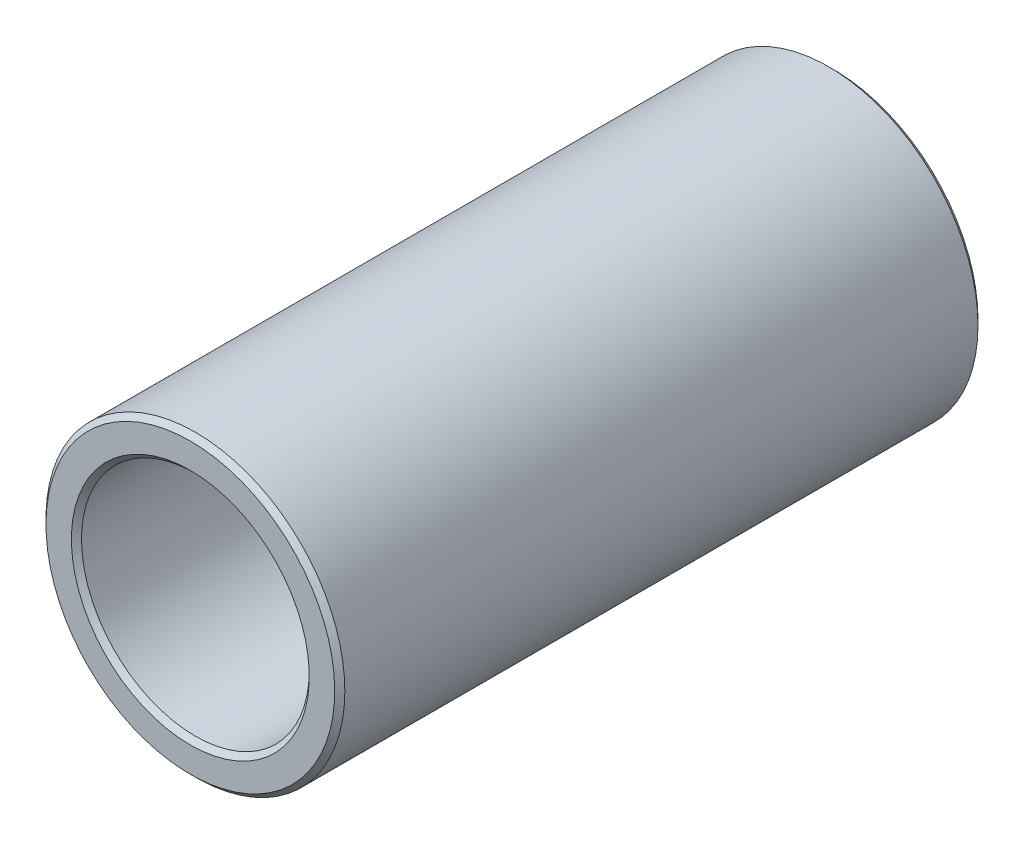
ISO-10303-21;
HEADER;
FILE_DESCRIPTION(('STEP AP214'),'2;1');
FILE_NAME('part.step','',(''),(''),'','','');
FILE_SCHEMA(('AUTOMOTIVE_DESIGN { 1 0 10303 214 1 1 1 1 }'));
ENDSEC;
DATA;
#1=APPLICATION_CONTEXT('core data for automotive mechanical design processes');
#2=APPLICATION_PROTOCOL_DEFINITION('international standard','automotive_design',2000,#1);
#3=PRODUCT_CONTEXT('',#1,'mechanical');
#4=PRODUCT('Part','Part','',(#3));
#5=PRODUCT_RELATED_PRODUCT_CATEGORY('part','',(#4));
#6=PRODUCT_DEFINITION_FORMATION('','',#4);
#7=PRODUCT_DEFINITION_CONTEXT('part definition',#1,'design');
#8=PRODUCT_DEFINITION('design','',#6,#7);
#9=PRODUCT_DEFINITION_SHAPE('','',#8);
#10=(LENGTH_UNIT() NAMED_UNIT(*) SI_UNIT(.MILLI.,.METRE.));
#11=(NAMED_UNIT(*) PLANE_ANGLE_UNIT() SI_UNIT($,.RADIAN.));
#12=(NAMED_UNIT(*) SI_UNIT($,.STERADIAN.) SOLID_ANGLE_UNIT());
#13=UNCERTAINTY_MEASURE_WITH_UNIT(LENGTH_MEASURE(1.E-05),#10,'distance_accuracy_value','');
#14=(GEOMETRIC_REPRESENTATION_CONTEXT(3) GLOBAL_UNCERTAINTY_ASSIGNED_CONTEXT((#13)) GLOBAL_UNIT_ASSIGNED_CONTEXT((#10,
#11,#12)) REPRESENTATION_CONTEXT('',''));
#15=CARTESIAN_POINT('',(0.,0.,0.));
#16=DIRECTION('',(0.,0.,1.));
#17=DIRECTION('',(1.,0.,0.));
#18=AXIS2_PLACEMENT_3D('',#15,#16,#17);
#19=CARTESIAN_POINT('',(0.,0.,7.37616));
#20=DIRECTION('',(0.,0.,1.));
#21=DIRECTION('',(1.,0.,0.));
#22=AXIS2_PLACEMENT_3D('',#19,#20,#21);
#23=CYLINDRICAL_SURFACE('',#22,2.2479);
#24=CARTESIAN_POINT('',(0.,0.,6.25000000002274));
#25=DIRECTION('',(0.,0.,1.));
#26=DIRECTION('',(1.,0.,0.));
#27=AXIS2_PLACEMENT_3D('',#24,#25,#26);
#28=CIRCLE('',#27,2.24790000004305);
#29=CARTESIAN_POINT('',(2.24790000004305,0.,6.25000000002274));
#30=VERTEX_POINT('',#29);
#31=EDGE_CURVE('E29',#30,#30,#28,.T.);
#32=ORIENTED_EDGE('',*,*,#31,.T.);
#33=EDGE_LOOP('',(#32));
#34=FACE_BOUND('',#33,.T.);
#35=CARTESIAN_POINT('',(0.,0.,-6.24999999996589));
#36=DIRECTION('',(0.,0.,-1.));
#37=DIRECTION('',(-1.,0.,0.));
#38=AXIS2_PLACEMENT_3D('',#35,#36,#37);
#39=CIRCLE('',#38,2.2478999999862);
#40=CARTESIAN_POINT('',(-2.2478999999862,0.,-6.24999999996589));
#41=VERTEX_POINT('',#40);
#42=EDGE_CURVE('E32',#41,#41,#39,.T.);
#43=ORIENTED_EDGE('',*,*,#42,.T.);
#44=EDGE_LOOP('',(#43));
#45=FACE_BOUND('',#44,.T.);
#46=ADVANCED_FACE('F14',(#34,#45),#23,.F.);
#47=CARTESIAN_POINT('',(0.,0.,-6.34999999994079));
#48=DIRECTION('',(0.,0.,-1.));
#49=DIRECTION('',(-1.,0.,0.));
#50=AXIS2_PLACEMENT_3D('',#47,#48,#49);
#51=CONICAL_SURFACE('',#50,2.34789999990426,0.785398163397448);
#52=CARTESIAN_POINT('',(0.,0.,-6.34999999999764));
#53=DIRECTION('',(0.,0.,-1.));
#54=DIRECTION('',(-1.,0.,0.));
#55=AXIS2_PLACEMENT_3D('',#52,#53,#54);
#56=CIRCLE('',#55,2.3478999999611);
#57=CARTESIAN_POINT('',(-2.3478999999611,0.,-6.34999999999764));
#58=VERTEX_POINT('',#57);
#59=EDGE_CURVE('E17',#58,#58,#56,.T.);
#60=ORIENTED_EDGE('',*,*,#59,.T.);
#61=EDGE_LOOP('',(#60));
#62=FACE_BOUND('',#61,.T.);
#63=ORIENTED_EDGE('',*,*,#42,.F.);
#64=EDGE_LOOP('',(#63));
#65=FACE_BOUND('',#64,.T.);
#66=ADVANCED_FACE('F46',(#62,#65),#51,.F.);
#67=CARTESIAN_POINT('',(0.,0.,6.34999999988395));
#68=DIRECTION('',(0.,0.,1.));
#69=DIRECTION('',(0.,-1.,0.));
#70=AXIS2_PLACEMENT_3D('',#67,#68,#69);
#71=CONICAL_SURFACE('',#70,2.34789999990426,0.785398163397448);
#72=CARTESIAN_POINT('',(0.,0.,6.34999999994079));
#73=DIRECTION('',(0.,0.,1.));
#74=DIRECTION('',(0.,-1.,0.));
#75=AXIS2_PLACEMENT_3D('',#72,#73,#74);
#76=CIRCLE('',#75,2.3478999999611);
#77=CARTESIAN_POINT('',(0.,-2.3478999999611,6.34999999994079));
#78=VERTEX_POINT('',#77);
#79=EDGE_CURVE('E39',#78,#78,#76,.T.);
#80=ORIENTED_EDGE('',*,*,#79,.T.);
#81=EDGE_LOOP('',(#80));
#82=FACE_BOUND('',#81,.T.);
#83=ORIENTED_EDGE('',*,*,#31,.F.);
#84=EDGE_LOOP('',(#83));
#85=FACE_BOUND('',#84,.T.);
#86=ADVANCED_FACE('F52',(#82,#85),#71,.F.);
#87=CARTESIAN_POINT('',(0.,2.95,-6.35));
#88=DIRECTION('',(0.,0.,1.));
#89=DIRECTION('',(1.,0.,0.));
#90=AXIS2_PLACEMENT_3D('',#87,#88,#89);
#91=PLANE('',#90);
#92=CARTESIAN_POINT('',(0.,0.,-6.35000000005448));
#93=DIRECTION('',(0.,0.,1.));
#94=DIRECTION('',(1.,0.,0.));
#95=AXIS2_PLACEMENT_3D('',#92,#93,#94);
#96=CIRCLE('',#95,2.84999999996671);
#97=CARTESIAN_POINT('',(2.84999999996671,0.,-6.35000000005448));
#98=VERTEX_POINT('',#97);
#99=EDGE_CURVE('E37',#98,#98,#96,.T.);
#100=ORIENTED_EDGE('',*,*,#99,.F.);
#101=EDGE_LOOP('',(#100));
#102=FACE_BOUND('',#101,.T.);
#103=ORIENTED_EDGE('',*,*,#59,.F.);
#104=EDGE_LOOP('',(#103));
#105=FACE_BOUND('',#104,.T.);
#106=ADVANCED_FACE('F49',(#102,#105),#91,.F.);
#107=CARTESIAN_POINT('',(0.,2.95,6.35));
#108=DIRECTION('',(0.,0.,-1.));
#109=DIRECTION('',(-1.,0.,0.));
#110=AXIS2_PLACEMENT_3D('',#107,#108,#109);
#111=PLANE('',#110);
#112=CARTESIAN_POINT('',(0.,0.,6.34999999999764));
#113=DIRECTION('',(0.,0.,-1.));
#114=DIRECTION('',(0.,1.,0.));
#115=AXIS2_PLACEMENT_3D('',#112,#113,#114);
#116=CIRCLE('',#115,2.8500000000804);
#117=CARTESIAN_POINT('',(0.,2.8500000000804,6.34999999999764));
#118=VERTEX_POINT('',#117);
#119=EDGE_CURVE('E26',#118,#118,#116,.T.);
#120=ORIENTED_EDGE('',*,*,#119,.F.);
#121=EDGE_LOOP('',(#120));
#122=FACE_BOUND('',#121,.T.);
#123=ORIENTED_EDGE('',*,*,#79,.F.);
#124=EDGE_LOOP('',(#123));
#125=FACE_BOUND('',#124,.T.);
#126=ADVANCED_FACE('F51',(#122,#125),#111,.F.);
#127=CARTESIAN_POINT('',(0.,0.,-6.25000000002274));
#128=DIRECTION('',(0.,0.,1.));
#129=DIRECTION('',(1.,0.,0.));
#130=AXIS2_PLACEMENT_3D('',#127,#128,#129);
#131=CONICAL_SURFACE('',#130,2.94999999999845,0.785398163397448);
#132=CARTESIAN_POINT('',(0.,0.,-6.25));
#133=DIRECTION('',(0.,0.,1.));
#134=DIRECTION('',(1.,0.,0.));
#135=AXIS2_PLACEMENT_3D('',#132,#133,#134);
#136=CIRCLE('',#135,2.95);
#137=CARTESIAN_POINT('',(2.95,0.,-6.25));
#138=VERTEX_POINT('',#137);
#139=EDGE_CURVE('E21',#138,#138,#136,.T.);
#140=ORIENTED_EDGE('',*,*,#139,.F.);
#141=EDGE_LOOP('',(#140));
#142=FACE_BOUND('',#141,.T.);
#143=ORIENTED_EDGE('',*,*,#99,.T.);
#144=EDGE_LOOP('',(#143));
#145=FACE_BOUND('',#144,.T.);
#146=ADVANCED_FACE('F60',(#142,#145),#131,.T.);
#147=CARTESIAN_POINT('',(0.,0.,6.25000000013642));
#148=DIRECTION('',(0.,0.,-1.));
#149=DIRECTION('',(0.,1.,0.));
#150=AXIS2_PLACEMENT_3D('',#147,#148,#149);
#151=CONICAL_SURFACE('',#150,2.94999999988477,0.785398163113231);
#152=CARTESIAN_POINT('',(0.,0.,6.25));
#153=DIRECTION('',(0.,0.,1.));
#154=DIRECTION('',(1.,0.,0.));
#155=AXIS2_PLACEMENT_3D('',#152,#153,#154);
#156=CIRCLE('',#155,2.95);
#157=CARTESIAN_POINT('',(2.95,0.,6.25));
#158=VERTEX_POINT('',#157);
#159=EDGE_CURVE('E10',#158,#158,#156,.F.);
#160=ORIENTED_EDGE('',*,*,#159,.F.);
#161=EDGE_LOOP('',(#160));
#162=FACE_BOUND('',#161,.T.);
#163=ORIENTED_EDGE('',*,*,#119,.T.);
#164=EDGE_LOOP('',(#163));
#165=FACE_BOUND('',#164,.T.);
#166=ADVANCED_FACE('F67',(#162,#165),#151,.T.);
#167=CARTESIAN_POINT('',(0.,0.,7.37616));
#168=DIRECTION('',(0.,0.,1.));
#169=DIRECTION('',(1.,0.,0.));
#170=AXIS2_PLACEMENT_3D('',#167,#168,#169);
#171=CYLINDRICAL_SURFACE('',#170,2.95);
#172=ORIENTED_EDGE('',*,*,#159,.T.);
#173=EDGE_LOOP('',(#172));
#174=FACE_BOUND('',#173,.T.);
#175=ORIENTED_EDGE('',*,*,#139,.T.);
#176=EDGE_LOOP('',(#175));
#177=FACE_BOUND('',#176,.T.);
#178=ADVANCED_FACE('F65',(#174,#177),#171,.T.);
#179=CLOSED_SHELL('',(#46,#66,#86,#106,#126,#146,#166,#178));
#180=MANIFOLD_SOLID_BREP('B1',#179);
#181=ADVANCED_BREP_SHAPE_REPRESENTATION('',(#18,#180),#14);
#182=SHAPE_DEFINITION_REPRESENTATION(#9,#181);
ENDSEC;
END-ISO-10303-21;
